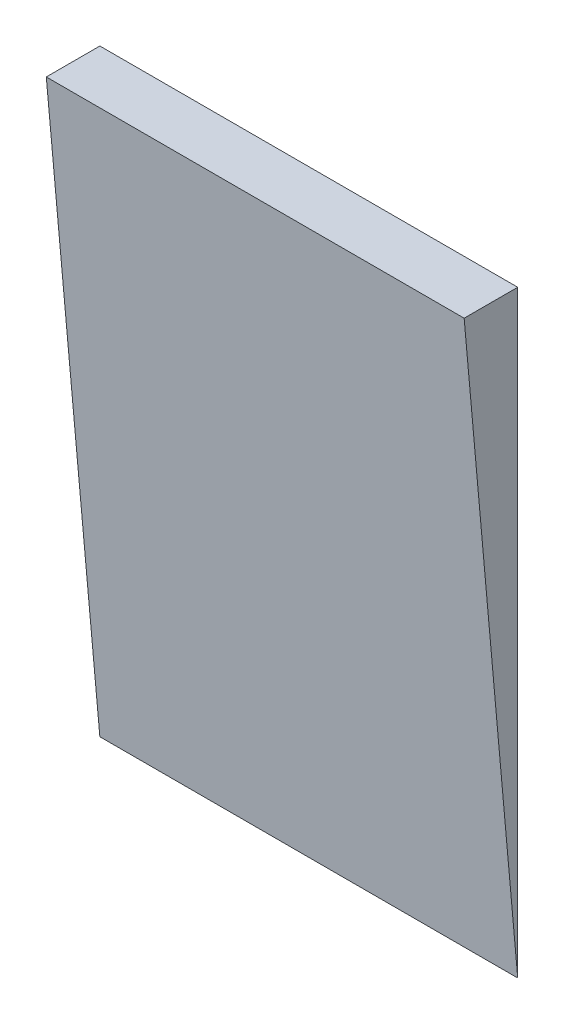
ISO-10303-21;
HEADER;
FILE_DESCRIPTION(('STEP AP214'),'2;1');
FILE_NAME('part.step','',(''),(''),'','','');
FILE_SCHEMA(('AUTOMOTIVE_DESIGN { 1 0 10303 214 1 1 1 1 }'));
ENDSEC;
DATA;
#1=APPLICATION_CONTEXT('core data for automotive mechanical design processes');
#2=APPLICATION_PROTOCOL_DEFINITION('international standard','automotive_design',2000,#1);
#3=PRODUCT_CONTEXT('',#1,'mechanical');
#4=PRODUCT('Part','Part','',(#3));
#5=PRODUCT_RELATED_PRODUCT_CATEGORY('part','',(#4));
#6=PRODUCT_DEFINITION_FORMATION('','',#4);
#7=PRODUCT_DEFINITION_CONTEXT('part definition',#1,'design');
#8=PRODUCT_DEFINITION('design','',#6,#7);
#9=PRODUCT_DEFINITION_SHAPE('','',#8);
#10=(LENGTH_UNIT() NAMED_UNIT(*) SI_UNIT(.MILLI.,.METRE.));
#11=(NAMED_UNIT(*) PLANE_ANGLE_UNIT() SI_UNIT($,.RADIAN.));
#12=(NAMED_UNIT(*) SI_UNIT($,.STERADIAN.) SOLID_ANGLE_UNIT());
#13=UNCERTAINTY_MEASURE_WITH_UNIT(LENGTH_MEASURE(1.E-05),#10,'distance_accuracy_value','');
#14=(GEOMETRIC_REPRESENTATION_CONTEXT(3) GLOBAL_UNCERTAINTY_ASSIGNED_CONTEXT((#13)) GLOBAL_UNIT_ASSIGNED_CONTEXT((#10,
#11,#12)) REPRESENTATION_CONTEXT('',''));
#15=CARTESIAN_POINT('',(0.,0.,0.));
#16=DIRECTION('',(0.,0.,1.));
#17=DIRECTION('',(1.,0.,0.));
#18=AXIS2_PLACEMENT_3D('',#15,#16,#17);
#19=CARTESIAN_POINT('',(-117.,0.,0.));
#20=DIRECTION('',(0.,1.,0.));
#21=DIRECTION('',(0.,0.,1.));
#22=AXIS2_PLACEMENT_3D('',#19,#20,#21);
#23=PLANE('',#22);
#24=DIRECTION('',(0.,0.,1.));
#25=VECTOR('',#24,1.);
#26=CARTESIAN_POINT('',(0.,0.,0.));
#27=LINE('',#26,#25);
#28=CARTESIAN_POINT('',(0.,0.,0.));
#29=VERTEX_POINT('',#28);
#30=CARTESIAN_POINT('',(0.,0.,15.));
#31=VERTEX_POINT('',#30);
#32=EDGE_CURVE('E85',#29,#31,#27,.T.);
#33=ORIENTED_EDGE('',*,*,#32,.F.);
#34=DIRECTION('',(1.,0.,0.));
#35=VECTOR('',#34,1.);
#36=CARTESIAN_POINT('',(-117.,0.,0.));
#37=LINE('',#36,#35);
#38=CARTESIAN_POINT('',(-117.,0.,0.));
#39=VERTEX_POINT('',#38);
#40=EDGE_CURVE('E11',#39,#29,#37,.T.);
#41=ORIENTED_EDGE('',*,*,#40,.F.);
#42=DIRECTION('',(0.,0.,1.));
#43=VECTOR('',#42,1.);
#44=CARTESIAN_POINT('',(-117.,0.,0.));
#45=LINE('',#44,#43);
#46=CARTESIAN_POINT('',(-117.,0.,15.));
#47=VERTEX_POINT('',#46);
#48=EDGE_CURVE('E77',#39,#47,#45,.T.);
#49=ORIENTED_EDGE('',*,*,#48,.T.);
#50=DIRECTION('',(1.,0.,0.));
#51=VECTOR('',#50,1.);
#52=CARTESIAN_POINT('',(-117.,0.,15.));
#53=LINE('',#52,#51);
#54=EDGE_CURVE('E36',#47,#31,#53,.T.);
#55=ORIENTED_EDGE('',*,*,#54,.T.);
#56=EDGE_LOOP('',(#33,#41,#49,#55));
#57=FACE_BOUND('',#56,.T.);
#58=ADVANCED_FACE('F33',(#57),#23,.T.);
#59=CARTESIAN_POINT('',(-117.,-167.497927018682,0.));
#60=DIRECTION('',(0.,0.,-1.));
#61=DIRECTION('',(0.,1.,0.));
#62=AXIS2_PLACEMENT_3D('',#59,#60,#61);
#63=PLANE('',#62);
#64=DIRECTION('',(0.,1.,0.));
#65=VECTOR('',#64,1.);
#66=CARTESIAN_POINT('',(0.,-167.497927018682,0.));
#67=LINE('',#66,#65);
#68=CARTESIAN_POINT('',(0.,-167.497927018682,0.));
#69=VERTEX_POINT('',#68);
#70=EDGE_CURVE('E79',#69,#29,#67,.T.);
#71=ORIENTED_EDGE('',*,*,#70,.F.);
#72=DIRECTION('',(1.,0.,0.));
#73=VECTOR('',#72,1.);
#74=CARTESIAN_POINT('',(-117.,-167.497927018682,0.));
#75=LINE('',#74,#73);
#76=CARTESIAN_POINT('',(-117.,-167.497927018682,0.));
#77=VERTEX_POINT('',#76);
#78=EDGE_CURVE('E42',#77,#69,#75,.T.);
#79=ORIENTED_EDGE('',*,*,#78,.F.);
#80=DIRECTION('',(0.,1.,0.));
#81=VECTOR('',#80,1.);
#82=CARTESIAN_POINT('',(-117.,-167.497927018682,0.));
#83=LINE('',#82,#81);
#84=EDGE_CURVE('E74',#77,#39,#83,.T.);
#85=ORIENTED_EDGE('',*,*,#84,.T.);
#86=ORIENTED_EDGE('',*,*,#40,.T.);
#87=EDGE_LOOP('',(#71,#79,#85,#86));
#88=FACE_BOUND('',#87,.T.);
#89=ADVANCED_FACE('F89',(#88),#63,.T.);
#90=CARTESIAN_POINT('',(-117.,0.,15.));
#91=DIRECTION('',(0.,-0.0891963926624926,0.99601405790079));
#92=DIRECTION('',(0.,-0.99601405790079,-0.0891963926624926));
#93=AXIS2_PLACEMENT_3D('',#90,#91,#92);
#94=PLANE('',#93);
#95=DIRECTION('',(0.,-0.99601405790079,-0.0891963926624926));
#96=VECTOR('',#95,1.);
#97=CARTESIAN_POINT('',(0.,0.,15.));
#98=LINE('',#97,#96);
#99=EDGE_CURVE('E72',#31,#69,#98,.T.);
#100=ORIENTED_EDGE('',*,*,#99,.F.);
#101=ORIENTED_EDGE('',*,*,#54,.F.);
#102=DIRECTION('',(0.,-0.99601405790079,-0.0891963926624926));
#103=VECTOR('',#102,1.);
#104=CARTESIAN_POINT('',(-117.,0.,15.));
#105=LINE('',#104,#103);
#106=EDGE_CURVE('E70',#47,#77,#105,.T.);
#107=ORIENTED_EDGE('',*,*,#106,.T.);
#108=ORIENTED_EDGE('',*,*,#78,.T.);
#109=EDGE_LOOP('',(#100,#101,#107,#108));
#110=FACE_BOUND('',#109,.T.);
#111=ADVANCED_FACE('F69',(#110),#94,.T.);
#112=CARTESIAN_POINT('',(-117.,0.,0.));
#113=DIRECTION('',(-1.,0.,0.));
#114=DIRECTION('',(0.,0.,1.));
#115=AXIS2_PLACEMENT_3D('',#112,#113,#114);
#116=PLANE('',#115);
#117=ORIENTED_EDGE('',*,*,#48,.F.);
#118=ORIENTED_EDGE('',*,*,#84,.F.);
#119=ORIENTED_EDGE('',*,*,#106,.F.);
#120=EDGE_LOOP('',(#117,#118,#119));
#121=FACE_BOUND('',#120,.T.);
#122=ADVANCED_FACE('F76',(#121),#116,.T.);
#123=CARTESIAN_POINT('',(0.,0.,0.));
#124=DIRECTION('',(-1.,0.,0.));
#125=DIRECTION('',(0.,0.,1.));
#126=AXIS2_PLACEMENT_3D('',#123,#124,#125);
#127=PLANE('',#126);
#128=ORIENTED_EDGE('',*,*,#32,.T.);
#129=ORIENTED_EDGE('',*,*,#99,.T.);
#130=ORIENTED_EDGE('',*,*,#70,.T.);
#131=EDGE_LOOP('',(#128,#129,#130));
#132=FACE_BOUND('',#131,.T.);
#133=ADVANCED_FACE('F88',(#132),#127,.F.);
#134=CLOSED_SHELL('',(#58,#89,#111,#122,#133));
#135=MANIFOLD_SOLID_BREP('B2',#134);
#136=ADVANCED_BREP_SHAPE_REPRESENTATION('',(#18,#135),#14);
#137=SHAPE_DEFINITION_REPRESENTATION(#9,#136);
ENDSEC;
END-ISO-10303-21;
